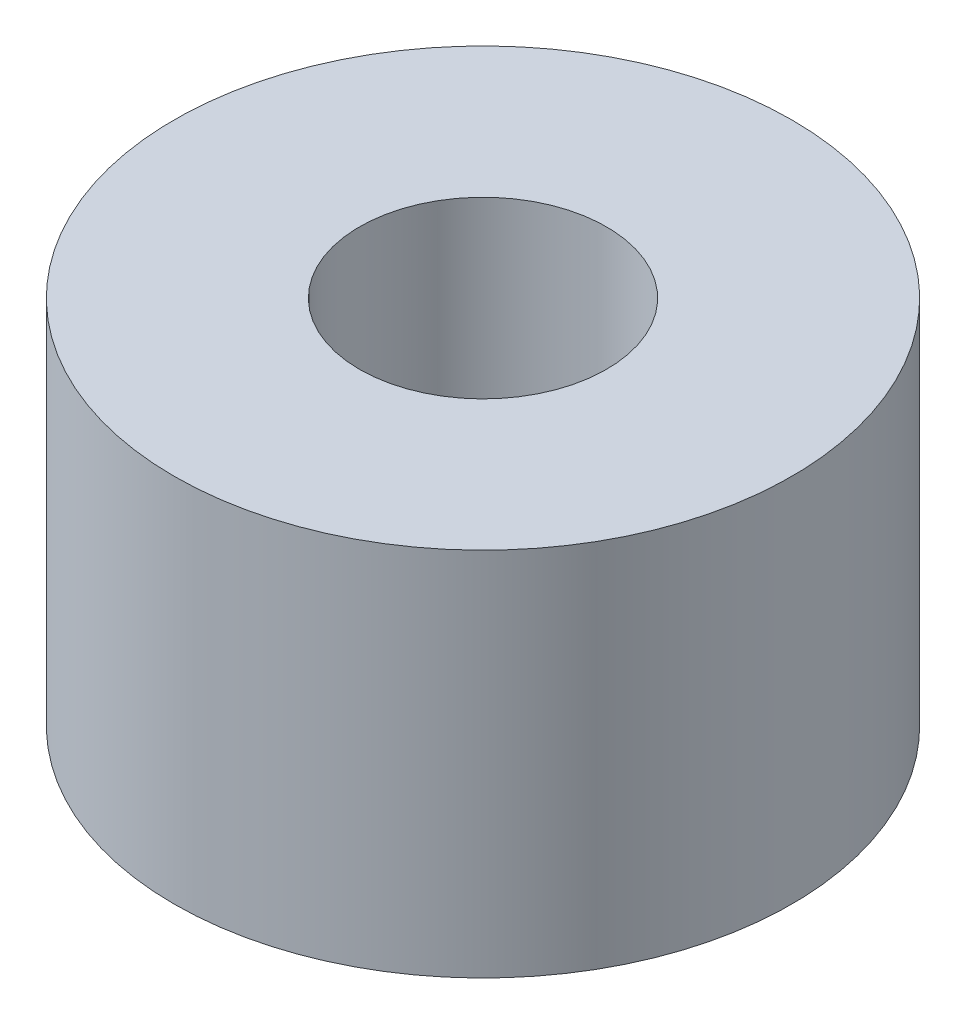
ISO-10303-21;
HEADER;
FILE_DESCRIPTION(('STEP AP214'),'2;1');
FILE_NAME('part.step','',(''),(''),'','','');
FILE_SCHEMA(('AUTOMOTIVE_DESIGN { 1 0 10303 214 1 1 1 1 }'));
ENDSEC;
DATA;
#1=APPLICATION_CONTEXT('core data for automotive mechanical design processes');
#2=APPLICATION_PROTOCOL_DEFINITION('international standard','automotive_design',2000,#1);
#3=PRODUCT_CONTEXT('',#1,'mechanical');
#4=PRODUCT('Part','Part','',(#3));
#5=PRODUCT_RELATED_PRODUCT_CATEGORY('part','',(#4));
#6=PRODUCT_DEFINITION_FORMATION('','',#4);
#7=PRODUCT_DEFINITION_CONTEXT('part definition',#1,'design');
#8=PRODUCT_DEFINITION('design','',#6,#7);
#9=PRODUCT_DEFINITION_SHAPE('','',#8);
#10=(LENGTH_UNIT() NAMED_UNIT(*) SI_UNIT(.MILLI.,.METRE.));
#11=(NAMED_UNIT(*) PLANE_ANGLE_UNIT() SI_UNIT($,.RADIAN.));
#12=(NAMED_UNIT(*) SI_UNIT($,.STERADIAN.) SOLID_ANGLE_UNIT());
#13=UNCERTAINTY_MEASURE_WITH_UNIT(LENGTH_MEASURE(1.E-05),#10,'distance_accuracy_value','');
#14=(GEOMETRIC_REPRESENTATION_CONTEXT(3) GLOBAL_UNCERTAINTY_ASSIGNED_CONTEXT((#13)) GLOBAL_UNIT_ASSIGNED_CONTEXT((#10,
#11,#12)) REPRESENTATION_CONTEXT('',''));
#15=CARTESIAN_POINT('',(0.,0.,0.));
#16=DIRECTION('',(0.,0.,1.));
#17=DIRECTION('',(1.,0.,0.));
#18=AXIS2_PLACEMENT_3D('',#15,#16,#17);
#19=CARTESIAN_POINT('',(0.,-12.,0.));
#20=DIRECTION('',(0.,1.,0.));
#21=DIRECTION('',(0.,0.,1.));
#22=AXIS2_PLACEMENT_3D('',#19,#20,#21);
#23=CYLINDRICAL_SURFACE('',#22,10.);
#24=CARTESIAN_POINT('',(0.,-12.,0.));
#25=DIRECTION('',(0.,1.,0.));
#26=DIRECTION('',(0.,0.,1.));
#27=AXIS2_PLACEMENT_3D('',#24,#25,#26);
#28=CIRCLE('',#27,10.);
#29=CARTESIAN_POINT('',(0.,-12.,10.));
#30=VERTEX_POINT('',#29);
#31=EDGE_CURVE('E10',#30,#30,#28,.T.);
#32=ORIENTED_EDGE('',*,*,#31,.T.);
#33=EDGE_LOOP('',(#32));
#34=FACE_BOUND('',#33,.T.);
#35=CARTESIAN_POINT('',(0.,0.,0.));
#36=DIRECTION('',(0.,1.,0.));
#37=DIRECTION('',(0.,0.,1.));
#38=AXIS2_PLACEMENT_3D('',#35,#36,#37);
#39=CIRCLE('',#38,10.);
#40=CARTESIAN_POINT('',(0.,0.,10.));
#41=VERTEX_POINT('',#40);
#42=EDGE_CURVE('E38',#41,#41,#39,.T.);
#43=ORIENTED_EDGE('',*,*,#42,.F.);
#44=EDGE_LOOP('',(#43));
#45=FACE_BOUND('',#44,.T.);
#46=ADVANCED_FACE('F35',(#34,#45),#23,.T.);
#47=CARTESIAN_POINT('',(0.,-12.,0.));
#48=DIRECTION('',(0.,1.,0.));
#49=DIRECTION('',(0.,0.,1.));
#50=AXIS2_PLACEMENT_3D('',#47,#48,#49);
#51=PLANE('',#50);
#52=CARTESIAN_POINT('',(0.,-12.,0.));
#53=DIRECTION('',(0.,1.,0.));
#54=DIRECTION('',(0.,0.,1.));
#55=AXIS2_PLACEMENT_3D('',#52,#53,#54);
#56=CIRCLE('',#55,4.);
#57=CARTESIAN_POINT('',(0.,-12.,4.));
#58=VERTEX_POINT('',#57);
#59=EDGE_CURVE('E45',#58,#58,#56,.T.);
#60=ORIENTED_EDGE('',*,*,#59,.T.);
#61=EDGE_LOOP('',(#60));
#62=FACE_BOUND('',#61,.T.);
#63=ORIENTED_EDGE('',*,*,#31,.F.);
#64=EDGE_LOOP('',(#63));
#65=FACE_BOUND('',#64,.T.);
#66=ADVANCED_FACE('F53',(#62,#65),#51,.F.);
#67=CARTESIAN_POINT('',(0.,0.,0.));
#68=DIRECTION('',(0.,1.,0.));
#69=DIRECTION('',(0.,0.,1.));
#70=AXIS2_PLACEMENT_3D('',#67,#68,#69);
#71=PLANE('',#70);
#72=CARTESIAN_POINT('',(0.,0.,0.));
#73=DIRECTION('',(0.,1.,0.));
#74=DIRECTION('',(0.,0.,1.));
#75=AXIS2_PLACEMENT_3D('',#72,#73,#74);
#76=CIRCLE('',#75,4.);
#77=CARTESIAN_POINT('',(0.,0.,4.));
#78=VERTEX_POINT('',#77);
#79=EDGE_CURVE('E47',#78,#78,#76,.T.);
#80=ORIENTED_EDGE('',*,*,#79,.F.);
#81=EDGE_LOOP('',(#80));
#82=FACE_BOUND('',#81,.T.);
#83=ORIENTED_EDGE('',*,*,#42,.T.);
#84=EDGE_LOOP('',(#83));
#85=FACE_BOUND('',#84,.T.);
#86=ADVANCED_FACE('F59',(#82,#85),#71,.T.);
#87=CARTESIAN_POINT('',(0.,-12.,0.));
#88=DIRECTION('',(0.,1.,0.));
#89=DIRECTION('',(0.,0.,1.));
#90=AXIS2_PLACEMENT_3D('',#87,#88,#89);
#91=CYLINDRICAL_SURFACE('',#90,4.);
#92=ORIENTED_EDGE('',*,*,#59,.F.);
#93=EDGE_LOOP('',(#92));
#94=FACE_BOUND('',#93,.T.);
#95=ORIENTED_EDGE('',*,*,#79,.T.);
#96=EDGE_LOOP('',(#95));
#97=FACE_BOUND('',#96,.T.);
#98=ADVANCED_FACE('F56',(#94,#97),#91,.F.);
#99=CLOSED_SHELL('',(#46,#66,#86,#98));
#100=MANIFOLD_SOLID_BREP('B2',#99);
#101=ADVANCED_BREP_SHAPE_REPRESENTATION('',(#18,#100),#14);
#102=SHAPE_DEFINITION_REPRESENTATION(#9,#101);
ENDSEC;
END-ISO-10303-21;
